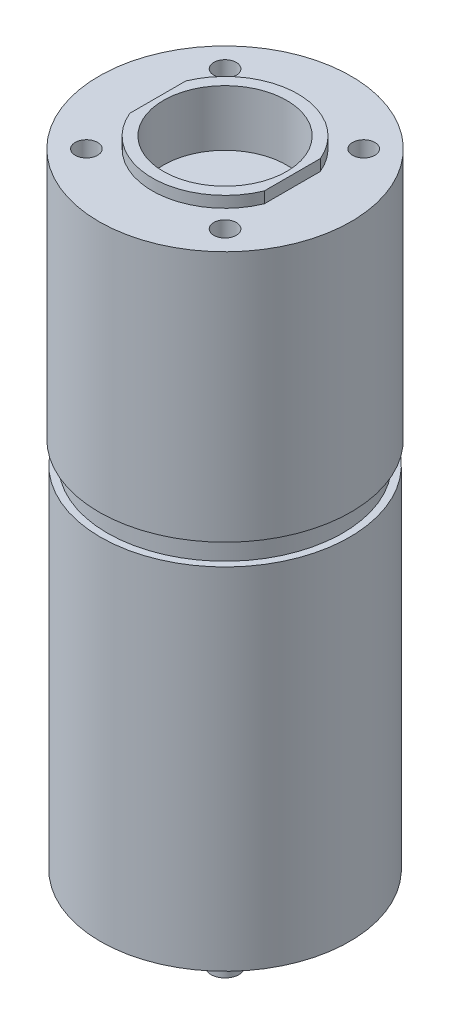
ISO-10303-21;
HEADER;
FILE_DESCRIPTION(('STEP AP214'),'2;1');
FILE_NAME('part.step','',(''),(''),'','','');
FILE_SCHEMA(('AUTOMOTIVE_DESIGN { 1 0 10303 214 1 1 1 1 }'));
ENDSEC;
DATA;
#1=APPLICATION_CONTEXT('core data for automotive mechanical design processes');
#2=APPLICATION_PROTOCOL_DEFINITION('international standard','automotive_design',2000,#1);
#3=PRODUCT_CONTEXT('',#1,'mechanical');
#4=PRODUCT('Part','Part','',(#3));
#5=PRODUCT_RELATED_PRODUCT_CATEGORY('part','',(#4));
#6=PRODUCT_DEFINITION_FORMATION('','',#4);
#7=PRODUCT_DEFINITION_CONTEXT('part definition',#1,'design');
#8=PRODUCT_DEFINITION('design','',#6,#7);
#9=PRODUCT_DEFINITION_SHAPE('','',#8);
#10=(LENGTH_UNIT() NAMED_UNIT(*) SI_UNIT(.MILLI.,.METRE.));
#11=(NAMED_UNIT(*) PLANE_ANGLE_UNIT() SI_UNIT($,.RADIAN.));
#12=(NAMED_UNIT(*) SI_UNIT($,.STERADIAN.) SOLID_ANGLE_UNIT());
#13=UNCERTAINTY_MEASURE_WITH_UNIT(LENGTH_MEASURE(1.E-05),#10,'distance_accuracy_value','');
#14=(GEOMETRIC_REPRESENTATION_CONTEXT(3) GLOBAL_UNCERTAINTY_ASSIGNED_CONTEXT((#13)) GLOBAL_UNIT_ASSIGNED_CONTEXT((#10,
#11,#12)) REPRESENTATION_CONTEXT('',''));
#15=CARTESIAN_POINT('',(0.,0.,0.));
#16=DIRECTION('',(0.,0.,1.));
#17=DIRECTION('',(1.,0.,0.));
#18=AXIS2_PLACEMENT_3D('',#15,#16,#17);
#19=CARTESIAN_POINT('',(0.,0.,0.));
#20=DIRECTION('',(0.,1.,0.));
#21=DIRECTION('',(0.,0.,1.));
#22=AXIS2_PLACEMENT_3D('',#19,#20,#21);
#23=CYLINDRICAL_SURFACE('',#22,13.);
#24=DIRECTION('',(0.,1.,0.));
#25=VECTOR('',#24,1.);
#26=CARTESIAN_POINT('',(-12.,0.,-5.));
#27=LINE('',#26,#25);
#28=CARTESIAN_POINT('',(-12.,0.,-5.));
#29=VERTEX_POINT('',#28);
#30=CARTESIAN_POINT('',(-12.,-2.,-5.));
#31=VERTEX_POINT('',#30);
#32=EDGE_CURVE('E130',#29,#31,#27,.F.);
#33=ORIENTED_EDGE('',*,*,#32,.F.);
#34=CARTESIAN_POINT('',(0.,0.,0.));
#35=DIRECTION('',(0.,1.,0.));
#36=DIRECTION('',(0.,0.,1.));
#37=AXIS2_PLACEMENT_3D('',#34,#35,#36);
#38=CIRCLE('',#37,13.);
#39=CARTESIAN_POINT('',(12.,0.,-5.));
#40=VERTEX_POINT('',#39);
#41=EDGE_CURVE('E11',#40,#29,#38,.T.);
#42=ORIENTED_EDGE('',*,*,#41,.F.);
#43=DIRECTION('',(0.,1.,0.));
#44=VECTOR('',#43,1.);
#45=CARTESIAN_POINT('',(12.,0.,-5.));
#46=LINE('',#45,#44);
#47=CARTESIAN_POINT('',(12.,-2.,-4.99999999999999));
#48=VERTEX_POINT('',#47);
#49=EDGE_CURVE('E78',#48,#40,#46,.T.);
#50=ORIENTED_EDGE('',*,*,#49,.F.);
#51=CARTESIAN_POINT('',(0.,-2.,0.));
#52=DIRECTION('',(0.,1.,0.));
#53=DIRECTION('',(0.,0.,1.));
#54=AXIS2_PLACEMENT_3D('',#51,#52,#53);
#55=CIRCLE('',#54,13.);
#56=EDGE_CURVE('E90',#48,#31,#55,.T.);
#57=ORIENTED_EDGE('',*,*,#56,.T.);
#58=EDGE_LOOP('',(#33,#42,#50,#57));
#59=FACE_BOUND('',#58,.T.);
#60=ADVANCED_FACE('F38',(#59),#23,.T.);
#61=CARTESIAN_POINT('',(0.,0.,0.));
#62=DIRECTION('',(0.,1.,0.));
#63=DIRECTION('',(0.,0.,1.));
#64=AXIS2_PLACEMENT_3D('',#61,#62,#63);
#65=PLANE('',#64);
#66=DIRECTION('',(0.,0.,-1.));
#67=VECTOR('',#66,1.);
#68=CARTESIAN_POINT('',(-12.,0.,-16.7871115774193));
#69=LINE('',#68,#67);
#70=CARTESIAN_POINT('',(-12.,0.,5.));
#71=VERTEX_POINT('',#70);
#72=EDGE_CURVE('E83',#71,#29,#69,.T.);
#73=ORIENTED_EDGE('',*,*,#72,.F.);
#74=CARTESIAN_POINT('',(12.,0.,5.));
#75=VERTEX_POINT('',#74);
#76=EDGE_CURVE('E42',#71,#75,#38,.T.);
#77=ORIENTED_EDGE('',*,*,#76,.T.);
#78=DIRECTION('',(0.,0.,1.));
#79=VECTOR('',#78,1.);
#80=CARTESIAN_POINT('',(12.,0.,-16.7871115774193));
#81=LINE('',#80,#79);
#82=EDGE_CURVE('E84',#40,#75,#81,.T.);
#83=ORIENTED_EDGE('',*,*,#82,.F.);
#84=ORIENTED_EDGE('',*,*,#41,.T.);
#85=EDGE_LOOP('',(#73,#77,#83,#84));
#86=FACE_BOUND('',#85,.T.);
#87=CARTESIAN_POINT('',(0.,0.,0.));
#88=DIRECTION('',(0.,1.,0.));
#89=DIRECTION('',(0.,0.,1.));
#90=AXIS2_PLACEMENT_3D('',#87,#88,#89);
#91=CIRCLE('',#90,11.);
#92=CARTESIAN_POINT('',(0.,0.,11.));
#93=VERTEX_POINT('',#92);
#94=EDGE_CURVE('E127',#93,#93,#91,.T.);
#95=ORIENTED_EDGE('',*,*,#94,.F.);
#96=EDGE_LOOP('',(#95));
#97=FACE_BOUND('',#96,.T.);
#98=ADVANCED_FACE('F40',(#86,#97),#65,.T.);
#99=DIRECTION('',(0.,1.,0.));
#100=VECTOR('',#99,1.);
#101=CARTESIAN_POINT('',(-12.,0.,5.));
#102=LINE('',#101,#100);
#103=CARTESIAN_POINT('',(-12.,-2.,5.));
#104=VERTEX_POINT('',#103);
#105=EDGE_CURVE('E134',#104,#71,#102,.T.);
#106=ORIENTED_EDGE('',*,*,#105,.F.);
#107=CARTESIAN_POINT('',(12.,-2.,4.99999999999999));
#108=VERTEX_POINT('',#107);
#109=EDGE_CURVE('E93',#104,#108,#55,.T.);
#110=ORIENTED_EDGE('',*,*,#109,.T.);
#111=DIRECTION('',(0.,1.,0.));
#112=VECTOR('',#111,1.);
#113=CARTESIAN_POINT('',(12.,0.,5.));
#114=LINE('',#113,#112);
#115=EDGE_CURVE('E81',#75,#108,#114,.F.);
#116=ORIENTED_EDGE('',*,*,#115,.F.);
#117=ORIENTED_EDGE('',*,*,#76,.F.);
#118=EDGE_LOOP('',(#106,#110,#116,#117));
#119=FACE_BOUND('',#118,.T.);
#120=ADVANCED_FACE('F177',(#119),#23,.T.);
#121=CARTESIAN_POINT('',(-13.,-2.,0.));
#122=DIRECTION('',(0.,1.,0.));
#123=DIRECTION('',(0.,0.,1.));
#124=AXIS2_PLACEMENT_3D('',#121,#122,#123);
#125=PLANE('',#124);
#126=CARTESIAN_POINT('',(-12.3743686707646,-2.,12.3743686707646));
#127=DIRECTION('',(0.,1.,0.));
#128=DIRECTION('',(0.,0.,1.));
#129=AXIS2_PLACEMENT_3D('',#126,#127,#128);
#130=CIRCLE('',#129,2.);
#131=CARTESIAN_POINT('',(-12.3743686707646,-2.,14.3743686707646));
#132=VERTEX_POINT('',#131);
#133=EDGE_CURVE('E147',#132,#132,#130,.T.);
#134=ORIENTED_EDGE('',*,*,#133,.F.);
#135=EDGE_LOOP('',(#134));
#136=FACE_BOUND('',#135,.T.);
#137=CARTESIAN_POINT('',(12.3743686707646,-2.,12.3743686707646));
#138=DIRECTION('',(0.,1.,0.));
#139=DIRECTION('',(0.,0.,1.));
#140=AXIS2_PLACEMENT_3D('',#137,#138,#139);
#141=CIRCLE('',#140,2.);
#142=CARTESIAN_POINT('',(12.3743686707646,-2.,14.3743686707646));
#143=VERTEX_POINT('',#142);
#144=EDGE_CURVE('E153',#143,#143,#141,.T.);
#145=ORIENTED_EDGE('',*,*,#144,.F.);
#146=EDGE_LOOP('',(#145));
#147=FACE_BOUND('',#146,.T.);
#148=CARTESIAN_POINT('',(12.3743686707646,-2.,-12.3743686707646));
#149=DIRECTION('',(0.,1.,0.));
#150=DIRECTION('',(0.,0.,1.));
#151=AXIS2_PLACEMENT_3D('',#148,#149,#150);
#152=CIRCLE('',#151,2.);
#153=CARTESIAN_POINT('',(12.3743686707646,-2.,-10.3743686707646));
#154=VERTEX_POINT('',#153);
#155=EDGE_CURVE('E159',#154,#154,#152,.T.);
#156=ORIENTED_EDGE('',*,*,#155,.F.);
#157=EDGE_LOOP('',(#156));
#158=FACE_BOUND('',#157,.T.);
#159=CARTESIAN_POINT('',(-12.3743686707646,-2.,-12.3743686707646));
#160=DIRECTION('',(0.,1.,0.));
#161=DIRECTION('',(0.,0.,1.));
#162=AXIS2_PLACEMENT_3D('',#159,#160,#161);
#163=CIRCLE('',#162,2.);
#164=CARTESIAN_POINT('',(-12.3743686707646,-2.,-10.3743686707646));
#165=VERTEX_POINT('',#164);
#166=EDGE_CURVE('E141',#165,#165,#163,.T.);
#167=ORIENTED_EDGE('',*,*,#166,.F.);
#168=EDGE_LOOP('',(#167));
#169=FACE_BOUND('',#168,.T.);
#170=CARTESIAN_POINT('',(0.,-2.,0.));
#171=DIRECTION('',(0.,1.,0.));
#172=DIRECTION('',(0.,0.,1.));
#173=AXIS2_PLACEMENT_3D('',#170,#171,#172);
#174=CIRCLE('',#173,22.5);
#175=CARTESIAN_POINT('',(0.,-2.,22.5));
#176=VERTEX_POINT('',#175);
#177=EDGE_CURVE('E95',#176,#176,#174,.T.);
#178=ORIENTED_EDGE('',*,*,#177,.T.);
#179=EDGE_LOOP('',(#178));
#180=FACE_BOUND('',#179,.T.);
#181=ORIENTED_EDGE('',*,*,#109,.F.);
#182=DIRECTION('',(0.,0.,-1.));
#183=VECTOR('',#182,1.);
#184=CARTESIAN_POINT('',(-12.,-2.,-16.7871115774193));
#185=LINE('',#184,#183);
#186=EDGE_CURVE('E53',#104,#31,#185,.T.);
#187=ORIENTED_EDGE('',*,*,#186,.T.);
#188=ORIENTED_EDGE('',*,*,#56,.F.);
#189=DIRECTION('',(0.,0.,1.));
#190=VECTOR('',#189,1.);
#191=CARTESIAN_POINT('',(12.,-2.,-16.7871115774193));
#192=LINE('',#191,#190);
#193=EDGE_CURVE('E58',#48,#108,#192,.T.);
#194=ORIENTED_EDGE('',*,*,#193,.T.);
#195=EDGE_LOOP('',(#181,#187,#188,#194));
#196=FACE_BOUND('',#195,.T.);
#197=ADVANCED_FACE('F92',(#136,#147,#158,#169,#180,#196),#125,.T.);
#198=CARTESIAN_POINT('',(0.,0.,0.));
#199=DIRECTION('',(0.,1.,0.));
#200=DIRECTION('',(0.,0.,1.));
#201=AXIS2_PLACEMENT_3D('',#198,#199,#200);
#202=CYLINDRICAL_SURFACE('',#201,22.5);
#203=CARTESIAN_POINT('',(0.,-46.9,0.));
#204=DIRECTION('',(0.,1.,0.));
#205=DIRECTION('',(0.,0.,1.));
#206=AXIS2_PLACEMENT_3D('',#203,#204,#205);
#207=CIRCLE('',#206,22.5);
#208=CARTESIAN_POINT('',(0.,-46.9,22.5));
#209=VERTEX_POINT('',#208);
#210=EDGE_CURVE('E99',#209,#209,#207,.T.);
#211=ORIENTED_EDGE('',*,*,#210,.T.);
#212=EDGE_LOOP('',(#211));
#213=FACE_BOUND('',#212,.T.);
#214=ORIENTED_EDGE('',*,*,#177,.F.);
#215=EDGE_LOOP('',(#214));
#216=FACE_BOUND('',#215,.T.);
#217=ADVANCED_FACE('F176',(#213,#216),#202,.T.);
#218=CARTESIAN_POINT('',(-22.5,-46.9,0.));
#219=DIRECTION('',(0.,-1.,0.));
#220=DIRECTION('',(0.,0.,-1.));
#221=AXIS2_PLACEMENT_3D('',#218,#219,#220);
#222=PLANE('',#221);
#223=CARTESIAN_POINT('',(0.,-46.9,0.));
#224=DIRECTION('',(0.,1.,0.));
#225=DIRECTION('',(0.,0.,1.));
#226=AXIS2_PLACEMENT_3D('',#223,#224,#225);
#227=CIRCLE('',#226,21.);
#228=CARTESIAN_POINT('',(0.,-46.9,21.));
#229=VERTEX_POINT('',#228);
#230=EDGE_CURVE('E102',#229,#229,#227,.T.);
#231=ORIENTED_EDGE('',*,*,#230,.T.);
#232=EDGE_LOOP('',(#231));
#233=FACE_BOUND('',#232,.T.);
#234=ORIENTED_EDGE('',*,*,#210,.F.);
#235=EDGE_LOOP('',(#234));
#236=FACE_BOUND('',#235,.T.);
#237=ADVANCED_FACE('F185',(#233,#236),#222,.T.);
#238=CARTESIAN_POINT('',(0.,0.,0.));
#239=DIRECTION('',(0.,1.,0.));
#240=DIRECTION('',(0.,0.,1.));
#241=AXIS2_PLACEMENT_3D('',#238,#239,#240);
#242=CYLINDRICAL_SURFACE('',#241,21.);
#243=CARTESIAN_POINT('',(0.,-50.9,0.));
#244=DIRECTION('',(0.,1.,0.));
#245=DIRECTION('',(0.,0.,1.));
#246=AXIS2_PLACEMENT_3D('',#243,#244,#245);
#247=CIRCLE('',#246,21.);
#248=CARTESIAN_POINT('',(0.,-50.9,21.));
#249=VERTEX_POINT('',#248);
#250=EDGE_CURVE('E105',#249,#249,#247,.T.);
#251=ORIENTED_EDGE('',*,*,#250,.T.);
#252=EDGE_LOOP('',(#251));
#253=FACE_BOUND('',#252,.T.);
#254=ORIENTED_EDGE('',*,*,#230,.F.);
#255=EDGE_LOOP('',(#254));
#256=FACE_BOUND('',#255,.T.);
#257=ADVANCED_FACE('F191',(#253,#256),#242,.T.);
#258=CARTESIAN_POINT('',(-21.,-50.9,0.));
#259=DIRECTION('',(0.,1.,0.));
#260=DIRECTION('',(0.,0.,1.));
#261=AXIS2_PLACEMENT_3D('',#258,#259,#260);
#262=PLANE('',#261);
#263=CARTESIAN_POINT('',(0.,-50.9,0.));
#264=DIRECTION('',(0.,1.,0.));
#265=DIRECTION('',(0.,0.,1.));
#266=AXIS2_PLACEMENT_3D('',#263,#264,#265);
#267=CIRCLE('',#266,22.25);
#268=CARTESIAN_POINT('',(0.,-50.9,22.25));
#269=VERTEX_POINT('',#268);
#270=EDGE_CURVE('E108',#269,#269,#267,.T.);
#271=ORIENTED_EDGE('',*,*,#270,.T.);
#272=EDGE_LOOP('',(#271));
#273=FACE_BOUND('',#272,.T.);
#274=ORIENTED_EDGE('',*,*,#250,.F.);
#275=EDGE_LOOP('',(#274));
#276=FACE_BOUND('',#275,.T.);
#277=ADVANCED_FACE('F247',(#273,#276),#262,.T.);
#278=CARTESIAN_POINT('',(0.,0.,0.));
#279=DIRECTION('',(0.,1.,0.));
#280=DIRECTION('',(0.,0.,1.));
#281=AXIS2_PLACEMENT_3D('',#278,#279,#280);
#282=CYLINDRICAL_SURFACE('',#281,22.25);
#283=CARTESIAN_POINT('',(0.,-113.4,0.));
#284=DIRECTION('',(0.,1.,0.));
#285=DIRECTION('',(0.,0.,1.));
#286=AXIS2_PLACEMENT_3D('',#283,#284,#285);
#287=CIRCLE('',#286,22.25);
#288=CARTESIAN_POINT('',(0.,-113.4,22.25));
#289=VERTEX_POINT('',#288);
#290=EDGE_CURVE('E111',#289,#289,#287,.T.);
#291=ORIENTED_EDGE('',*,*,#290,.T.);
#292=EDGE_LOOP('',(#291));
#293=FACE_BOUND('',#292,.T.);
#294=ORIENTED_EDGE('',*,*,#270,.F.);
#295=EDGE_LOOP('',(#294));
#296=FACE_BOUND('',#295,.T.);
#297=ADVANCED_FACE('F243',(#293,#296),#282,.T.);
#298=CARTESIAN_POINT('',(-22.25,-113.4,0.));
#299=DIRECTION('',(0.,-1.,0.));
#300=DIRECTION('',(0.,0.,-1.));
#301=AXIS2_PLACEMENT_3D('',#298,#299,#300);
#302=PLANE('',#301);
#303=CARTESIAN_POINT('',(0.,-113.4,0.));
#304=DIRECTION('',(0.,1.,0.));
#305=DIRECTION('',(0.,0.,1.));
#306=AXIS2_PLACEMENT_3D('',#303,#304,#305);
#307=CIRCLE('',#306,5.99999999999997);
#308=CARTESIAN_POINT('',(0.,-113.4,5.99999999999997));
#309=VERTEX_POINT('',#308);
#310=EDGE_CURVE('E114',#309,#309,#307,.T.);
#311=ORIENTED_EDGE('',*,*,#310,.T.);
#312=EDGE_LOOP('',(#311));
#313=FACE_BOUND('',#312,.T.);
#314=ORIENTED_EDGE('',*,*,#290,.F.);
#315=EDGE_LOOP('',(#314));
#316=FACE_BOUND('',#315,.T.);
#317=ADVANCED_FACE('F239',(#313,#316),#302,.T.);
#318=CARTESIAN_POINT('',(0.,0.,0.));
#319=DIRECTION('',(0.,1.,0.));
#320=DIRECTION('',(0.,0.,1.));
#321=AXIS2_PLACEMENT_3D('',#318,#319,#320);
#322=CYLINDRICAL_SURFACE('',#321,5.99999999999997);
#323=CARTESIAN_POINT('',(0.,-118.4,0.));
#324=DIRECTION('',(0.,1.,0.));
#325=DIRECTION('',(0.,0.,1.));
#326=AXIS2_PLACEMENT_3D('',#323,#324,#325);
#327=CIRCLE('',#326,5.99999999999997);
#328=CARTESIAN_POINT('',(0.,-118.4,5.99999999999997));
#329=VERTEX_POINT('',#328);
#330=EDGE_CURVE('E117',#329,#329,#327,.T.);
#331=ORIENTED_EDGE('',*,*,#330,.T.);
#332=EDGE_LOOP('',(#331));
#333=FACE_BOUND('',#332,.T.);
#334=ORIENTED_EDGE('',*,*,#310,.F.);
#335=EDGE_LOOP('',(#334));
#336=FACE_BOUND('',#335,.T.);
#337=ADVANCED_FACE('F235',(#333,#336),#322,.T.);
#338=CARTESIAN_POINT('',(-5.99999999999997,-118.4,0.));
#339=DIRECTION('',(0.,-1.,0.));
#340=DIRECTION('',(0.,0.,-1.));
#341=AXIS2_PLACEMENT_3D('',#338,#339,#340);
#342=PLANE('',#341);
#343=CARTESIAN_POINT('',(0.,-118.4,0.));
#344=DIRECTION('',(0.,1.,0.));
#345=DIRECTION('',(0.,0.,1.));
#346=AXIS2_PLACEMENT_3D('',#343,#344,#345);
#347=CIRCLE('',#346,2.49999999999999);
#348=CARTESIAN_POINT('',(0.,-118.4,2.49999999999999));
#349=VERTEX_POINT('',#348);
#350=EDGE_CURVE('E120',#349,#349,#347,.T.);
#351=ORIENTED_EDGE('',*,*,#350,.T.);
#352=EDGE_LOOP('',(#351));
#353=FACE_BOUND('',#352,.T.);
#354=ORIENTED_EDGE('',*,*,#330,.F.);
#355=EDGE_LOOP('',(#354));
#356=FACE_BOUND('',#355,.T.);
#357=ADVANCED_FACE('F231',(#353,#356),#342,.T.);
#358=CARTESIAN_POINT('',(0.,0.,0.));
#359=DIRECTION('',(0.,1.,0.));
#360=DIRECTION('',(0.,0.,1.));
#361=AXIS2_PLACEMENT_3D('',#358,#359,#360);
#362=CYLINDRICAL_SURFACE('',#361,2.49999999999998);
#363=CARTESIAN_POINT('',(0.,-128.4,0.));
#364=DIRECTION('',(0.,1.,0.));
#365=DIRECTION('',(0.,0.,1.));
#366=AXIS2_PLACEMENT_3D('',#363,#364,#365);
#367=CIRCLE('',#366,2.49999999999998);
#368=CARTESIAN_POINT('',(0.,-128.4,2.49999999999998));
#369=VERTEX_POINT('',#368);
#370=EDGE_CURVE('E123',#369,#369,#367,.T.);
#371=ORIENTED_EDGE('',*,*,#370,.T.);
#372=EDGE_LOOP('',(#371));
#373=FACE_BOUND('',#372,.T.);
#374=ORIENTED_EDGE('',*,*,#350,.F.);
#375=EDGE_LOOP('',(#374));
#376=FACE_BOUND('',#375,.T.);
#377=ADVANCED_FACE('F223',(#373,#376),#362,.T.);
#378=CARTESIAN_POINT('',(-2.49999999999998,-128.4,0.));
#379=DIRECTION('',(0.,-1.,0.));
#380=DIRECTION('',(0.,0.,-1.));
#381=AXIS2_PLACEMENT_3D('',#378,#379,#380);
#382=PLANE('',#381);
#383=ORIENTED_EDGE('',*,*,#370,.F.);
#384=EDGE_LOOP('',(#383));
#385=FACE_BOUND('',#384,.T.);
#386=ADVANCED_FACE('F214',(#385),#382,.T.);
#387=CARTESIAN_POINT('',(0.,-10.,0.));
#388=DIRECTION('',(0.,1.,0.));
#389=DIRECTION('',(0.,0.,1.));
#390=AXIS2_PLACEMENT_3D('',#387,#388,#389);
#391=CYLINDRICAL_SURFACE('',#390,11.);
#392=CARTESIAN_POINT('',(0.,-10.,0.));
#393=DIRECTION('',(0.,1.,0.));
#394=DIRECTION('',(0.,0.,1.));
#395=AXIS2_PLACEMENT_3D('',#392,#393,#394);
#396=CIRCLE('',#395,11.);
#397=CARTESIAN_POINT('',(0.,-10.,11.));
#398=VERTEX_POINT('',#397);
#399=EDGE_CURVE('E126',#398,#398,#396,.T.);
#400=ORIENTED_EDGE('',*,*,#399,.F.);
#401=EDGE_LOOP('',(#400));
#402=FACE_BOUND('',#401,.T.);
#403=ORIENTED_EDGE('',*,*,#94,.T.);
#404=EDGE_LOOP('',(#403));
#405=FACE_BOUND('',#404,.T.);
#406=ADVANCED_FACE('F211',(#402,#405),#391,.F.);
#407=CARTESIAN_POINT('',(0.,-10.,0.));
#408=DIRECTION('',(0.,1.,0.));
#409=DIRECTION('',(0.,0.,1.));
#410=AXIS2_PLACEMENT_3D('',#407,#408,#409);
#411=PLANE('',#410);
#412=ORIENTED_EDGE('',*,*,#399,.T.);
#413=EDGE_LOOP('',(#412));
#414=FACE_BOUND('',#413,.T.);
#415=ADVANCED_FACE('F213',(#414),#411,.T.);
#416=CARTESIAN_POINT('',(12.,-2.,-16.7871115774193));
#417=DIRECTION('',(-1.,0.,0.));
#418=DIRECTION('',(0.,0.,1.));
#419=AXIS2_PLACEMENT_3D('',#416,#417,#418);
#420=PLANE('',#419);
#421=ORIENTED_EDGE('',*,*,#115,.T.);
#422=ORIENTED_EDGE('',*,*,#193,.F.);
#423=ORIENTED_EDGE('',*,*,#49,.T.);
#424=ORIENTED_EDGE('',*,*,#82,.T.);
#425=EDGE_LOOP('',(#421,#422,#423,#424));
#426=FACE_BOUND('',#425,.T.);
#427=ADVANCED_FACE('F77',(#426),#420,.F.);
#428=CARTESIAN_POINT('',(-12.,-2.,-16.7871115774193));
#429=DIRECTION('',(1.,0.,0.));
#430=DIRECTION('',(0.,0.,-1.));
#431=AXIS2_PLACEMENT_3D('',#428,#429,#430);
#432=PLANE('',#431);
#433=ORIENTED_EDGE('',*,*,#32,.T.);
#434=ORIENTED_EDGE('',*,*,#186,.F.);
#435=ORIENTED_EDGE('',*,*,#105,.T.);
#436=ORIENTED_EDGE('',*,*,#72,.T.);
#437=EDGE_LOOP('',(#433,#434,#435,#436));
#438=FACE_BOUND('',#437,.T.);
#439=ADVANCED_FACE('F207',(#438),#432,.F.);
#440=CARTESIAN_POINT('',(-12.3743686707646,-11.,-12.3743686707646));
#441=DIRECTION('',(0.,1.,0.));
#442=DIRECTION('',(0.,0.,1.));
#443=AXIS2_PLACEMENT_3D('',#440,#441,#442);
#444=CYLINDRICAL_SURFACE('',#443,2.);
#445=CARTESIAN_POINT('',(-12.3743686707646,-11.,-12.3743686707646));
#446=DIRECTION('',(0.,1.,0.));
#447=DIRECTION('',(0.,0.,1.));
#448=AXIS2_PLACEMENT_3D('',#445,#446,#447);
#449=CIRCLE('',#448,2.);
#450=CARTESIAN_POINT('',(-12.3743686707646,-11.,-10.3743686707646));
#451=VERTEX_POINT('',#450);
#452=EDGE_CURVE('E137',#451,#451,#449,.T.);
#453=ORIENTED_EDGE('',*,*,#452,.F.);
#454=EDGE_LOOP('',(#453));
#455=FACE_BOUND('',#454,.T.);
#456=ORIENTED_EDGE('',*,*,#166,.T.);
#457=EDGE_LOOP('',(#456));
#458=FACE_BOUND('',#457,.T.);
#459=ADVANCED_FACE('F339',(#455,#458),#444,.F.);
#460=CARTESIAN_POINT('',(-12.3743686707646,-11.,-12.3743686707646));
#461=DIRECTION('',(0.,1.,0.));
#462=DIRECTION('',(0.,0.,1.));
#463=AXIS2_PLACEMENT_3D('',#460,#461,#462);
#464=PLANE('',#463);
#465=ORIENTED_EDGE('',*,*,#452,.T.);
#466=EDGE_LOOP('',(#465));
#467=FACE_BOUND('',#466,.T.);
#468=ADVANCED_FACE('F170',(#467),#464,.T.);
#469=CARTESIAN_POINT('',(12.3743686707646,-11.,-12.3743686707646));
#470=DIRECTION('',(0.,1.,0.));
#471=DIRECTION('',(0.,0.,1.));
#472=AXIS2_PLACEMENT_3D('',#469,#470,#471);
#473=CYLINDRICAL_SURFACE('',#472,2.);
#474=CARTESIAN_POINT('',(12.3743686707646,-11.,-12.3743686707646));
#475=DIRECTION('',(0.,1.,0.));
#476=DIRECTION('',(0.,0.,1.));
#477=AXIS2_PLACEMENT_3D('',#474,#475,#476);
#478=CIRCLE('',#477,2.);
#479=CARTESIAN_POINT('',(12.3743686707646,-11.,-10.3743686707646));
#480=VERTEX_POINT('',#479);
#481=EDGE_CURVE('E144',#480,#480,#478,.T.);
#482=ORIENTED_EDGE('',*,*,#481,.F.);
#483=EDGE_LOOP('',(#482));
#484=FACE_BOUND('',#483,.T.);
#485=ORIENTED_EDGE('',*,*,#155,.T.);
#486=EDGE_LOOP('',(#485));
#487=FACE_BOUND('',#486,.T.);
#488=ADVANCED_FACE('F167',(#484,#487),#473,.F.);
#489=CARTESIAN_POINT('',(12.3743686707646,-11.,-12.3743686707646));
#490=DIRECTION('',(0.,1.,0.));
#491=DIRECTION('',(0.,0.,1.));
#492=AXIS2_PLACEMENT_3D('',#489,#490,#491);
#493=PLANE('',#492);
#494=ORIENTED_EDGE('',*,*,#481,.T.);
#495=EDGE_LOOP('',(#494));
#496=FACE_BOUND('',#495,.T.);
#497=ADVANCED_FACE('F165',(#496),#493,.T.);
#498=CARTESIAN_POINT('',(12.3743686707646,-11.,12.3743686707646));
#499=DIRECTION('',(0.,1.,0.));
#500=DIRECTION('',(0.,0.,1.));
#501=AXIS2_PLACEMENT_3D('',#498,#499,#500);
#502=CYLINDRICAL_SURFACE('',#501,2.);
#503=CARTESIAN_POINT('',(12.3743686707646,-11.,12.3743686707646));
#504=DIRECTION('',(0.,1.,0.));
#505=DIRECTION('',(0.,0.,1.));
#506=AXIS2_PLACEMENT_3D('',#503,#504,#505);
#507=CIRCLE('',#506,2.);
#508=CARTESIAN_POINT('',(12.3743686707646,-11.,14.3743686707646));
#509=VERTEX_POINT('',#508);
#510=EDGE_CURVE('E156',#509,#509,#507,.T.);
#511=ORIENTED_EDGE('',*,*,#510,.F.);
#512=EDGE_LOOP('',(#511));
#513=FACE_BOUND('',#512,.T.);
#514=ORIENTED_EDGE('',*,*,#144,.T.);
#515=EDGE_LOOP('',(#514));
#516=FACE_BOUND('',#515,.T.);
#517=ADVANCED_FACE('F377',(#513,#516),#502,.F.);
#518=CARTESIAN_POINT('',(12.3743686707646,-11.,12.3743686707646));
#519=DIRECTION('',(0.,1.,0.));
#520=DIRECTION('',(0.,0.,1.));
#521=AXIS2_PLACEMENT_3D('',#518,#519,#520);
#522=PLANE('',#521);
#523=ORIENTED_EDGE('',*,*,#510,.T.);
#524=EDGE_LOOP('',(#523));
#525=FACE_BOUND('',#524,.T.);
#526=ADVANCED_FACE('F386',(#525),#522,.T.);
#527=CARTESIAN_POINT('',(-12.3743686707646,-11.,12.3743686707646));
#528=DIRECTION('',(0.,1.,0.));
#529=DIRECTION('',(0.,0.,1.));
#530=AXIS2_PLACEMENT_3D('',#527,#528,#529);
#531=CYLINDRICAL_SURFACE('',#530,2.);
#532=CARTESIAN_POINT('',(-12.3743686707646,-11.,12.3743686707646));
#533=DIRECTION('',(0.,1.,0.));
#534=DIRECTION('',(0.,0.,1.));
#535=AXIS2_PLACEMENT_3D('',#532,#533,#534);
#536=CIRCLE('',#535,2.);
#537=CARTESIAN_POINT('',(-12.3743686707646,-11.,14.3743686707646));
#538=VERTEX_POINT('',#537);
#539=EDGE_CURVE('E150',#538,#538,#536,.T.);
#540=ORIENTED_EDGE('',*,*,#539,.F.);
#541=EDGE_LOOP('',(#540));
#542=FACE_BOUND('',#541,.T.);
#543=ORIENTED_EDGE('',*,*,#133,.T.);
#544=EDGE_LOOP('',(#543));
#545=FACE_BOUND('',#544,.T.);
#546=ADVANCED_FACE('F396',(#542,#545),#531,.F.);
#547=CARTESIAN_POINT('',(-12.3743686707646,-11.,12.3743686707646));
#548=DIRECTION('',(0.,1.,0.));
#549=DIRECTION('',(0.,0.,1.));
#550=AXIS2_PLACEMENT_3D('',#547,#548,#549);
#551=PLANE('',#550);
#552=ORIENTED_EDGE('',*,*,#539,.T.);
#553=EDGE_LOOP('',(#552));
#554=FACE_BOUND('',#553,.T.);
#555=ADVANCED_FACE('F406',(#554),#551,.T.);
#556=CLOSED_SHELL('',(#60,#98,#120,#197,#217,#237,#257,#277,#297,#317,#337,#357,#377,#386,#406,
#415,#427,#439,#459,#468,#488,#497,#517,#526,#546,#555));
#557=MANIFOLD_SOLID_BREP('B2',#556);
#558=ADVANCED_BREP_SHAPE_REPRESENTATION('',(#18,#557),#14);
#559=SHAPE_DEFINITION_REPRESENTATION(#9,#558);
ENDSEC;
END-ISO-10303-21;
